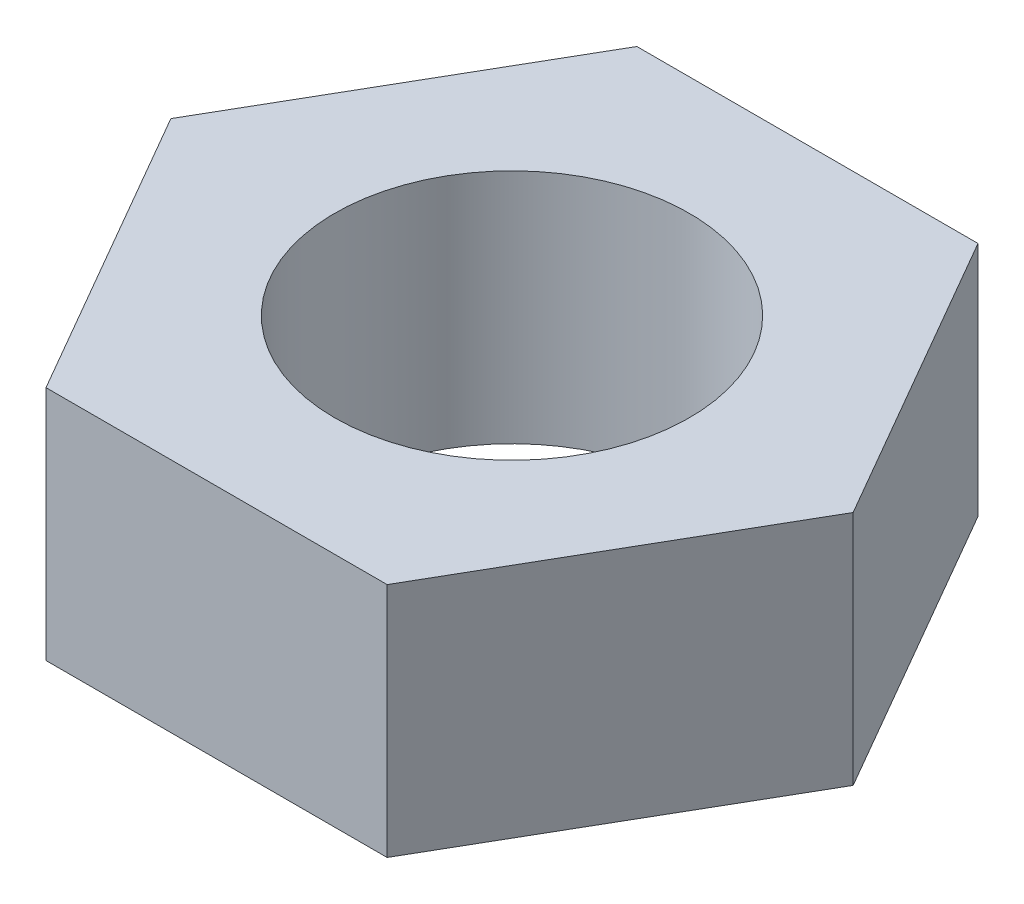
ISO-10303-21;
HEADER;
FILE_DESCRIPTION(('STEP AP214'),'2;1');
FILE_NAME('part.step','',(''),(''),'','','');
FILE_SCHEMA(('AUTOMOTIVE_DESIGN { 1 0 10303 214 1 1 1 1 }'));
ENDSEC;
DATA;
#1=APPLICATION_CONTEXT('core data for automotive mechanical design processes');
#2=APPLICATION_PROTOCOL_DEFINITION('international standard','automotive_design',2000,#1);
#3=PRODUCT_CONTEXT('',#1,'mechanical');
#4=PRODUCT('Part','Part','',(#3));
#5=PRODUCT_RELATED_PRODUCT_CATEGORY('part','',(#4));
#6=PRODUCT_DEFINITION_FORMATION('','',#4);
#7=PRODUCT_DEFINITION_CONTEXT('part definition',#1,'design');
#8=PRODUCT_DEFINITION('design','',#6,#7);
#9=PRODUCT_DEFINITION_SHAPE('','',#8);
#10=(LENGTH_UNIT() NAMED_UNIT(*) SI_UNIT(.MILLI.,.METRE.));
#11=(NAMED_UNIT(*) PLANE_ANGLE_UNIT() SI_UNIT($,.RADIAN.));
#12=(NAMED_UNIT(*) SI_UNIT($,.STERADIAN.) SOLID_ANGLE_UNIT());
#13=UNCERTAINTY_MEASURE_WITH_UNIT(LENGTH_MEASURE(1.E-05),#10,'distance_accuracy_value','');
#14=(GEOMETRIC_REPRESENTATION_CONTEXT(3) GLOBAL_UNCERTAINTY_ASSIGNED_CONTEXT((#13)) GLOBAL_UNIT_ASSIGNED_CONTEXT((#10,
#11,#12)) REPRESENTATION_CONTEXT('',''));
#15=CARTESIAN_POINT('',(0.,0.,0.));
#16=DIRECTION('',(0.,0.,1.));
#17=DIRECTION('',(1.,0.,0.));
#18=AXIS2_PLACEMENT_3D('',#15,#16,#17);
#19=CARTESIAN_POINT('',(0.,3.,0.));
#20=DIRECTION('',(0.,1.,0.));
#21=DIRECTION('',(0.,0.,1.));
#22=AXIS2_PLACEMENT_3D('',#19,#20,#21);
#23=PLANE('',#22);
#24=DIRECTION('',(-0.5,0.,-0.866025403784439));
#25=VECTOR('',#24,1.);
#26=CARTESIAN_POINT('',(4.33012701892219,3.,0.));
#27=LINE('',#26,#25);
#28=CARTESIAN_POINT('',(4.33012701892219,3.,0.));
#29=VERTEX_POINT('',#28);
#30=CARTESIAN_POINT('',(2.1650635094611,3.,-3.75));
#31=VERTEX_POINT('',#30);
#32=EDGE_CURVE('E146',#29,#31,#27,.T.);
#33=ORIENTED_EDGE('',*,*,#32,.T.);
#34=DIRECTION('',(-1.,0.,0.));
#35=VECTOR('',#34,1.);
#36=CARTESIAN_POINT('',(2.1650635094611,3.,-3.75));
#37=LINE('',#36,#35);
#38=CARTESIAN_POINT('',(-2.1650635094611,3.,-3.75));
#39=VERTEX_POINT('',#38);
#40=EDGE_CURVE('E94',#31,#39,#37,.T.);
#41=ORIENTED_EDGE('',*,*,#40,.T.);
#42=DIRECTION('',(-0.5,0.,0.866025403784439));
#43=VECTOR('',#42,1.);
#44=CARTESIAN_POINT('',(-2.1650635094611,3.,-3.75));
#45=LINE('',#44,#43);
#46=CARTESIAN_POINT('',(-4.33012701892219,3.,0.));
#47=VERTEX_POINT('',#46);
#48=EDGE_CURVE('E107',#39,#47,#45,.T.);
#49=ORIENTED_EDGE('',*,*,#48,.T.);
#50=DIRECTION('',(0.5,0.,0.866025403784439));
#51=VECTOR('',#50,1.);
#52=CARTESIAN_POINT('',(-4.33012701892219,3.,0.));
#53=LINE('',#52,#51);
#54=CARTESIAN_POINT('',(-2.1650635094611,3.,3.75));
#55=VERTEX_POINT('',#54);
#56=EDGE_CURVE('E101',#47,#55,#53,.T.);
#57=ORIENTED_EDGE('',*,*,#56,.T.);
#58=DIRECTION('',(1.,0.,0.));
#59=VECTOR('',#58,1.);
#60=CARTESIAN_POINT('',(-2.1650635094611,3.,3.75));
#61=LINE('',#60,#59);
#62=CARTESIAN_POINT('',(2.1650635094611,3.,3.75));
#63=VERTEX_POINT('',#62);
#64=EDGE_CURVE('E105',#55,#63,#61,.T.);
#65=ORIENTED_EDGE('',*,*,#64,.T.);
#66=DIRECTION('',(0.5,0.,-0.866025403784439));
#67=VECTOR('',#66,1.);
#68=CARTESIAN_POINT('',(2.1650635094611,3.,3.75));
#69=LINE('',#68,#67);
#70=EDGE_CURVE('E57',#63,#29,#69,.T.);
#71=ORIENTED_EDGE('',*,*,#70,.T.);
#72=EDGE_LOOP('',(#33,#41,#49,#57,#65,#71));
#73=FACE_BOUND('',#72,.T.);
#74=CARTESIAN_POINT('',(0.,3.,0.));
#75=DIRECTION('',(0.,1.,0.));
#76=DIRECTION('',(0.,0.,1.));
#77=AXIS2_PLACEMENT_3D('',#74,#75,#76);
#78=CIRCLE('',#77,2.25);
#79=CARTESIAN_POINT('',(0.,3.,2.25));
#80=VERTEX_POINT('',#79);
#81=EDGE_CURVE('E134',#80,#80,#78,.T.);
#82=ORIENTED_EDGE('',*,*,#81,.F.);
#83=EDGE_LOOP('',(#82));
#84=FACE_BOUND('',#83,.T.);
#85=ADVANCED_FACE('F39',(#73,#84),#23,.T.);
#86=CARTESIAN_POINT('',(0.,0.,0.));
#87=DIRECTION('',(0.,1.,0.));
#88=DIRECTION('',(0.,0.,1.));
#89=AXIS2_PLACEMENT_3D('',#86,#87,#88);
#90=PLANE('',#89);
#91=DIRECTION('',(-0.5,0.,-0.866025403784439));
#92=VECTOR('',#91,1.);
#93=CARTESIAN_POINT('',(4.33012701892219,0.,0.));
#94=LINE('',#93,#92);
#95=CARTESIAN_POINT('',(4.33012701892219,0.,0.));
#96=VERTEX_POINT('',#95);
#97=CARTESIAN_POINT('',(2.1650635094611,0.,-3.75));
#98=VERTEX_POINT('',#97);
#99=EDGE_CURVE('E129',#96,#98,#94,.T.);
#100=ORIENTED_EDGE('',*,*,#99,.F.);
#101=DIRECTION('',(0.5,0.,-0.866025403784439));
#102=VECTOR('',#101,1.);
#103=CARTESIAN_POINT('',(2.1650635094611,0.,3.75));
#104=LINE('',#103,#102);
#105=CARTESIAN_POINT('',(2.1650635094611,0.,3.75));
#106=VERTEX_POINT('',#105);
#107=EDGE_CURVE('E86',#106,#96,#104,.T.);
#108=ORIENTED_EDGE('',*,*,#107,.F.);
#109=DIRECTION('',(1.,0.,0.));
#110=VECTOR('',#109,1.);
#111=CARTESIAN_POINT('',(-2.1650635094611,0.,3.75));
#112=LINE('',#111,#110);
#113=CARTESIAN_POINT('',(-2.1650635094611,0.,3.75));
#114=VERTEX_POINT('',#113);
#115=EDGE_CURVE('E80',#114,#106,#112,.T.);
#116=ORIENTED_EDGE('',*,*,#115,.F.);
#117=DIRECTION('',(0.5,0.,0.866025403784439));
#118=VECTOR('',#117,1.);
#119=CARTESIAN_POINT('',(-4.33012701892219,0.,0.));
#120=LINE('',#119,#118);
#121=CARTESIAN_POINT('',(-4.33012701892219,0.,0.));
#122=VERTEX_POINT('',#121);
#123=EDGE_CURVE('E116',#122,#114,#120,.T.);
#124=ORIENTED_EDGE('',*,*,#123,.F.);
#125=DIRECTION('',(-0.5,0.,0.866025403784439));
#126=VECTOR('',#125,1.);
#127=CARTESIAN_POINT('',(-2.1650635094611,0.,-3.75));
#128=LINE('',#127,#126);
#129=CARTESIAN_POINT('',(-2.1650635094611,0.,-3.75));
#130=VERTEX_POINT('',#129);
#131=EDGE_CURVE('E137',#130,#122,#128,.T.);
#132=ORIENTED_EDGE('',*,*,#131,.F.);
#133=DIRECTION('',(-1.,0.,0.));
#134=VECTOR('',#133,1.);
#135=CARTESIAN_POINT('',(2.1650635094611,0.,-3.75));
#136=LINE('',#135,#134);
#137=EDGE_CURVE('E133',#98,#130,#136,.T.);
#138=ORIENTED_EDGE('',*,*,#137,.F.);
#139=EDGE_LOOP('',(#100,#108,#116,#124,#132,#138));
#140=FACE_BOUND('',#139,.T.);
#141=CARTESIAN_POINT('',(0.,0.,0.));
#142=DIRECTION('',(0.,1.,0.));
#143=DIRECTION('',(0.,0.,1.));
#144=AXIS2_PLACEMENT_3D('',#141,#142,#143);
#145=CIRCLE('',#144,2.25);
#146=CARTESIAN_POINT('',(0.,0.,2.25));
#147=VERTEX_POINT('',#146);
#148=EDGE_CURVE('E243',#147,#147,#145,.T.);
#149=ORIENTED_EDGE('',*,*,#148,.T.);
#150=EDGE_LOOP('',(#149));
#151=FACE_BOUND('',#150,.T.);
#152=ADVANCED_FACE('F159',(#140,#151),#90,.F.);
#153=CARTESIAN_POINT('',(4.33012701892219,3.,0.));
#154=DIRECTION('',(-0.866025403784438,0.,0.5));
#155=DIRECTION('',(0.5,0.,0.866025403784439));
#156=AXIS2_PLACEMENT_3D('',#153,#154,#155);
#157=PLANE('',#156);
#158=ORIENTED_EDGE('',*,*,#99,.T.);
#159=DIRECTION('',(0.,-1.,0.));
#160=VECTOR('',#159,1.);
#161=CARTESIAN_POINT('',(2.1650635094611,3.,-3.75));
#162=LINE('',#161,#160);
#163=EDGE_CURVE('E11',#31,#98,#162,.T.);
#164=ORIENTED_EDGE('',*,*,#163,.F.);
#165=ORIENTED_EDGE('',*,*,#32,.F.);
#166=DIRECTION('',(0.,-1.,0.));
#167=VECTOR('',#166,1.);
#168=CARTESIAN_POINT('',(4.33012701892219,3.,0.));
#169=LINE('',#168,#167);
#170=EDGE_CURVE('E125',#29,#96,#169,.T.);
#171=ORIENTED_EDGE('',*,*,#170,.T.);
#172=EDGE_LOOP('',(#158,#164,#165,#171));
#173=FACE_BOUND('',#172,.T.);
#174=ADVANCED_FACE('F41',(#173),#157,.F.);
#175=CARTESIAN_POINT('',(2.1650635094611,3.,-3.75));
#176=DIRECTION('',(0.,0.,1.));
#177=DIRECTION('',(1.,0.,0.));
#178=AXIS2_PLACEMENT_3D('',#175,#176,#177);
#179=PLANE('',#178);
#180=ORIENTED_EDGE('',*,*,#137,.T.);
#181=DIRECTION('',(0.,-1.,0.));
#182=VECTOR('',#181,1.);
#183=CARTESIAN_POINT('',(-2.1650635094611,3.,-3.75));
#184=LINE('',#183,#182);
#185=EDGE_CURVE('E49',#39,#130,#184,.T.);
#186=ORIENTED_EDGE('',*,*,#185,.F.);
#187=ORIENTED_EDGE('',*,*,#40,.F.);
#188=ORIENTED_EDGE('',*,*,#163,.T.);
#189=EDGE_LOOP('',(#180,#186,#187,#188));
#190=FACE_BOUND('',#189,.T.);
#191=ADVANCED_FACE('F184',(#190),#179,.F.);
#192=CARTESIAN_POINT('',(-2.1650635094611,3.,-3.75));
#193=DIRECTION('',(0.866025403784439,0.,0.5));
#194=DIRECTION('',(0.5,0.,-0.866025403784439));
#195=AXIS2_PLACEMENT_3D('',#192,#193,#194);
#196=PLANE('',#195);
#197=ORIENTED_EDGE('',*,*,#131,.T.);
#198=DIRECTION('',(0.,-1.,0.));
#199=VECTOR('',#198,1.);
#200=CARTESIAN_POINT('',(-4.33012701892219,3.,0.));
#201=LINE('',#200,#199);
#202=EDGE_CURVE('E118',#47,#122,#201,.T.);
#203=ORIENTED_EDGE('',*,*,#202,.F.);
#204=ORIENTED_EDGE('',*,*,#48,.F.);
#205=ORIENTED_EDGE('',*,*,#185,.T.);
#206=EDGE_LOOP('',(#197,#203,#204,#205));
#207=FACE_BOUND('',#206,.T.);
#208=ADVANCED_FACE('F156',(#207),#196,.F.);
#209=CARTESIAN_POINT('',(-4.33012701892219,3.,0.));
#210=DIRECTION('',(0.866025403784439,0.,-0.5));
#211=DIRECTION('',(-0.5,0.,-0.866025403784439));
#212=AXIS2_PLACEMENT_3D('',#209,#210,#211);
#213=PLANE('',#212);
#214=ORIENTED_EDGE('',*,*,#123,.T.);
#215=DIRECTION('',(0.,-1.,0.));
#216=VECTOR('',#215,1.);
#217=CARTESIAN_POINT('',(-2.1650635094611,3.,3.75));
#218=LINE('',#217,#216);
#219=EDGE_CURVE('E113',#55,#114,#218,.T.);
#220=ORIENTED_EDGE('',*,*,#219,.F.);
#221=ORIENTED_EDGE('',*,*,#56,.F.);
#222=ORIENTED_EDGE('',*,*,#202,.T.);
#223=EDGE_LOOP('',(#214,#220,#221,#222));
#224=FACE_BOUND('',#223,.T.);
#225=ADVANCED_FACE('F114',(#224),#213,.F.);
#226=CARTESIAN_POINT('',(-2.1650635094611,3.,3.75));
#227=DIRECTION('',(0.,0.,-1.));
#228=DIRECTION('',(-1.,0.,0.));
#229=AXIS2_PLACEMENT_3D('',#226,#227,#228);
#230=PLANE('',#229);
#231=ORIENTED_EDGE('',*,*,#115,.T.);
#232=DIRECTION('',(0.,-1.,0.));
#233=VECTOR('',#232,1.);
#234=CARTESIAN_POINT('',(2.1650635094611,3.,3.75));
#235=LINE('',#234,#233);
#236=EDGE_CURVE('E119',#63,#106,#235,.T.);
#237=ORIENTED_EDGE('',*,*,#236,.F.);
#238=ORIENTED_EDGE('',*,*,#64,.F.);
#239=ORIENTED_EDGE('',*,*,#219,.T.);
#240=EDGE_LOOP('',(#231,#237,#238,#239));
#241=FACE_BOUND('',#240,.T.);
#242=ADVANCED_FACE('F121',(#241),#230,.F.);
#243=CARTESIAN_POINT('',(2.1650635094611,3.,3.75));
#244=DIRECTION('',(-0.866025403784439,0.,-0.5));
#245=DIRECTION('',(-0.5,0.,0.866025403784439));
#246=AXIS2_PLACEMENT_3D('',#243,#244,#245);
#247=PLANE('',#246);
#248=ORIENTED_EDGE('',*,*,#107,.T.);
#249=ORIENTED_EDGE('',*,*,#170,.F.);
#250=ORIENTED_EDGE('',*,*,#70,.F.);
#251=ORIENTED_EDGE('',*,*,#236,.T.);
#252=EDGE_LOOP('',(#248,#249,#250,#251));
#253=FACE_BOUND('',#252,.T.);
#254=ADVANCED_FACE('F164',(#253),#247,.F.);
#255=CARTESIAN_POINT('',(0.,3.,0.));
#256=DIRECTION('',(0.,-1.,0.));
#257=DIRECTION('',(0.,0.,-1.));
#258=AXIS2_PLACEMENT_3D('',#255,#256,#257);
#259=CYLINDRICAL_SURFACE('',#258,2.25);
#260=ORIENTED_EDGE('',*,*,#81,.T.);
#261=EDGE_LOOP('',(#260));
#262=FACE_BOUND('',#261,.T.);
#263=ORIENTED_EDGE('',*,*,#148,.F.);
#264=EDGE_LOOP('',(#263));
#265=FACE_BOUND('',#264,.T.);
#266=ADVANCED_FACE('F166',(#262,#265),#259,.F.);
#267=CLOSED_SHELL('',(#85,#152,#174,#191,#208,#225,#242,#254,#266));
#268=MANIFOLD_SOLID_BREP('B2',#267);
#269=ADVANCED_BREP_SHAPE_REPRESENTATION('',(#18,#268),#14);
#270=SHAPE_DEFINITION_REPRESENTATION(#9,#269);
ENDSEC;
END-ISO-10303-21;
